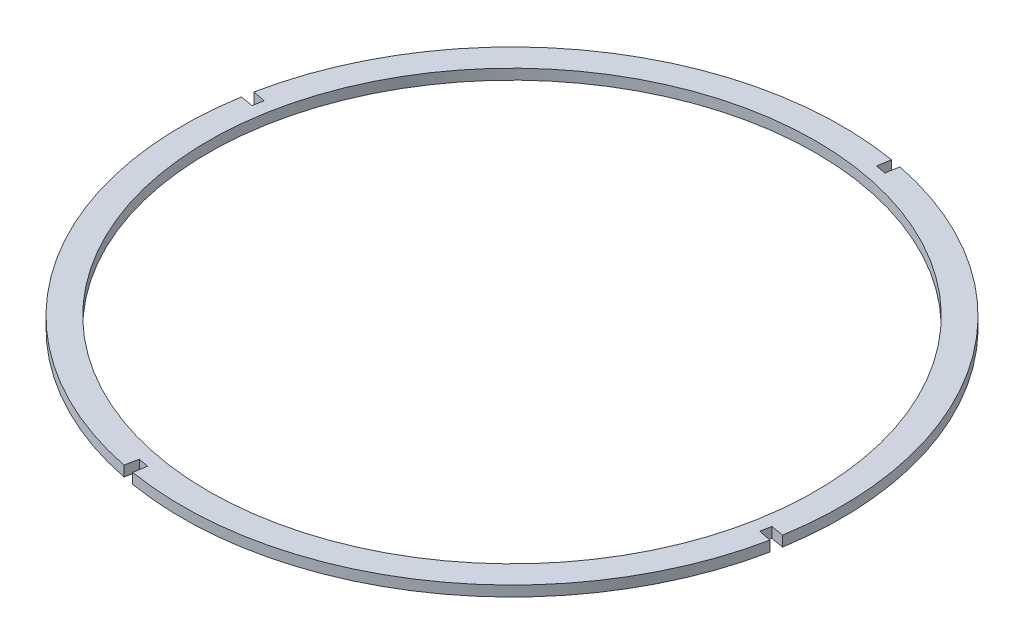
ISO-10303-21;
HEADER;
FILE_DESCRIPTION(('STEP AP214'),'2;1');
FILE_NAME('part.step','',(''),(''),'','','');
FILE_SCHEMA(('AUTOMOTIVE_DESIGN { 1 0 10303 214 1 1 1 1 }'));
ENDSEC;
DATA;
#1=APPLICATION_CONTEXT('core data for automotive mechanical design processes');
#2=APPLICATION_PROTOCOL_DEFINITION('international standard','automotive_design',2000,#1);
#3=PRODUCT_CONTEXT('',#1,'mechanical');
#4=PRODUCT('Part','Part','',(#3));
#5=PRODUCT_RELATED_PRODUCT_CATEGORY('part','',(#4));
#6=PRODUCT_DEFINITION_FORMATION('','',#4);
#7=PRODUCT_DEFINITION_CONTEXT('part definition',#1,'design');
#8=PRODUCT_DEFINITION('design','',#6,#7);
#9=PRODUCT_DEFINITION_SHAPE('','',#8);
#10=(LENGTH_UNIT() NAMED_UNIT(*) SI_UNIT(.MILLI.,.METRE.));
#11=(NAMED_UNIT(*) PLANE_ANGLE_UNIT() SI_UNIT($,.RADIAN.));
#12=(NAMED_UNIT(*) SI_UNIT($,.STERADIAN.) SOLID_ANGLE_UNIT());
#13=UNCERTAINTY_MEASURE_WITH_UNIT(LENGTH_MEASURE(1.E-05),#10,'distance_accuracy_value','');
#14=(GEOMETRIC_REPRESENTATION_CONTEXT(3) GLOBAL_UNCERTAINTY_ASSIGNED_CONTEXT((#13)) GLOBAL_UNIT_ASSIGNED_CONTEXT((#10,
#11,#12)) REPRESENTATION_CONTEXT('',''));
#15=CARTESIAN_POINT('',(0.,0.,0.));
#16=DIRECTION('',(0.,0.,1.));
#17=DIRECTION('',(1.,0.,0.));
#18=AXIS2_PLACEMENT_3D('',#15,#16,#17);
#19=CARTESIAN_POINT('',(-403.465651025362,16.,-173.034669454398));
#20=DIRECTION('',(0.,1.,0.));
#21=DIRECTION('',(0.,0.,1.));
#22=AXIS2_PLACEMENT_3D('',#19,#20,#21);
#23=PLANE('',#22);
#24=DIRECTION('',(0.165240023498245,0.,-0.986253382571791));
#25=VECTOR('',#24,1.);
#26=CARTESIAN_POINT('',(-322.977946121397,16.,-653.43445115636));
#27=LINE('',#26,#25);
#28=CARTESIAN_POINT('',(-322.977946121397,16.,-653.43445115636));
#29=VERTEX_POINT('',#28);
#30=CARTESIAN_POINT('',(-319.684001911055,16.,-673.094722019775));
#31=VERTEX_POINT('',#30);
#32=EDGE_CURVE('E242',#29,#31,#27,.T.);
#33=ORIENTED_EDGE('',*,*,#32,.T.);
#34=CARTESIAN_POINT('',(-403.465651025362,16.,-173.034669454398));
#35=DIRECTION('',(0.,1.,0.));
#36=DIRECTION('',(0.,0.,1.));
#37=AXIS2_PLACEMENT_3D('',#34,#35,#36);
#38=CIRCLE('',#37,507.03);
#39=CARTESIAN_POINT('',(-900.568839522135,16.,-272.873744401742));
#40=VERTEX_POINT('',#39);
#41=EDGE_CURVE('E130',#31,#40,#38,.T.);
#42=ORIENTED_EDGE('',*,*,#41,.T.);
#43=DIRECTION('',(0.983406473892087,0.,0.181415840287255));
#44=VECTOR('',#43,1.);
#45=CARTESIAN_POINT('',(-880.962779282727,16.,-269.256877940637));
#46=LINE('',#45,#44);
#47=CARTESIAN_POINT('',(-880.962779282727,16.,-269.256877940637));
#48=VERTEX_POINT('',#47);
#49=EDGE_CURVE('E295',#40,#48,#46,.T.);
#50=ORIENTED_EDGE('',*,*,#49,.T.);
#51=DIRECTION('',(-0.181415840287255,0.,0.983406473892088));
#52=VECTOR('',#51,1.);
#53=CARTESIAN_POINT('',(-880.962779282727,16.,-269.256877940637));
#54=LINE('',#53,#52);
#55=CARTESIAN_POINT('',(-883.865432727323,16.,-253.522374358363));
#56=VERTEX_POINT('',#55);
#57=EDGE_CURVE('E315',#48,#56,#54,.T.);
#58=ORIENTED_EDGE('',*,*,#57,.T.);
#59=DIRECTION('',(-0.986253382571794,0.,-0.165240023498229));
#60=VECTOR('',#59,1.);
#61=CARTESIAN_POINT('',(-883.865432727323,16.,-253.522374358363));
#62=LINE('',#61,#60);
#63=CARTESIAN_POINT('',(-903.525703590738,16.,-256.816318568705));
#64=VERTEX_POINT('',#63);
#65=EDGE_CURVE('E311',#56,#64,#62,.T.);
#66=ORIENTED_EDGE('',*,*,#65,.T.);
#67=CARTESIAN_POINT('',(-403.465651025362,16.,-173.034669454398));
#68=DIRECTION('',(0.,1.,0.));
#69=DIRECTION('',(0.,0.,1.));
#70=AXIS2_PLACEMENT_3D('',#67,#68,#69);
#71=CIRCLE('',#70,507.03);
#72=CARTESIAN_POINT('',(-503.338418417205,16.,324.061751004948));
#73=VERTEX_POINT('',#72);
#74=EDGE_CURVE('E314',#64,#73,#71,.T.);
#75=ORIENTED_EDGE('',*,*,#74,.T.);
#76=DIRECTION('',(0.196976051499661,0.,-0.98040830021762));
#77=VECTOR('',#76,1.);
#78=CARTESIAN_POINT('',(-499.411387281602,16.,304.515750913845));
#79=LINE('',#78,#77);
#80=CARTESIAN_POINT('',(-499.411387281602,16.,304.515750913845));
#81=VERTEX_POINT('',#80);
#82=EDGE_CURVE('E319',#73,#81,#79,.T.);
#83=ORIENTED_EDGE('',*,*,#82,.T.);
#84=DIRECTION('',(0.983458871104074,0.,0.181131578822411));
#85=VECTOR('',#84,1.);
#86=CARTESIAN_POINT('',(-499.411387281602,16.,304.515750913845));
#87=LINE('',#86,#85);
#88=CARTESIAN_POINT('',(-483.676045343937,16.,307.413856175003));
#89=VERTEX_POINT('',#88);
#90=EDGE_CURVE('E326',#81,#89,#87,.T.);
#91=ORIENTED_EDGE('',*,*,#90,.T.);
#92=DIRECTION('',(-0.164669920608711,0.,0.986348730037567));
#93=VECTOR('',#92,1.);
#94=CARTESIAN_POINT('',(-483.676045343937,16.,307.413856175003));
#95=LINE('',#94,#93);
#96=CARTESIAN_POINT('',(-486.958240871571,16.,327.073727136553));
#97=VERTEX_POINT('',#96);
#98=EDGE_CURVE('E329',#89,#97,#95,.T.);
#99=ORIENTED_EDGE('',*,*,#98,.T.);
#100=CARTESIAN_POINT('',(-403.465651025362,16.,-173.034669454398));
#101=DIRECTION('',(0.,1.,0.));
#102=DIRECTION('',(0.,0.,1.));
#103=AXIS2_PLACEMENT_3D('',#100,#101,#102);
#104=CIRCLE('',#103,507.03);
#105=CARTESIAN_POINT('',(93.5729575482181,16.,-72.8745851531181));
#106=VERTEX_POINT('',#105);
#107=EDGE_CURVE('E332',#97,#106,#104,.T.);
#108=ORIENTED_EDGE('',*,*,#107,.T.);
#109=DIRECTION('',(-0.980294279576317,0.,-0.197542717987653));
#110=VECTOR('',#109,1.);
#111=CARTESIAN_POINT('',(74.0314772320035,16.,-76.8124609681598));
#112=LINE('',#111,#110);
#113=CARTESIAN_POINT('',(74.0314772320035,16.,-76.8124609681598));
#114=VERTEX_POINT('',#113);
#115=EDGE_CURVE('E335',#106,#114,#112,.T.);
#116=ORIENTED_EDGE('',*,*,#115,.T.);
#117=DIRECTION('',(0.181415840287255,0.,-0.983406473892088));
#118=VECTOR('',#117,1.);
#119=CARTESIAN_POINT('',(76.9341306765996,16.,-92.5469645504332));
#120=LINE('',#119,#118);
#121=CARTESIAN_POINT('',(76.9341306765996,16.,-92.5469645504332));
#122=VERTEX_POINT('',#121);
#123=EDGE_CURVE('E338',#114,#122,#120,.T.);
#124=ORIENTED_EDGE('',*,*,#123,.T.);
#125=DIRECTION('',(0.986253382571794,0.,0.165240023498226));
#126=VECTOR('',#125,1.);
#127=CARTESIAN_POINT('',(76.9341306765996,16.,-92.5469645504332));
#128=LINE('',#127,#126);
#129=CARTESIAN_POINT('',(96.5944015400149,16.,-89.2530203400915));
#130=VERTEX_POINT('',#129);
#131=EDGE_CURVE('E173',#122,#130,#128,.T.);
#132=ORIENTED_EDGE('',*,*,#131,.T.);
#133=CARTESIAN_POINT('',(-403.465651025362,16.,-173.034669454398));
#134=DIRECTION('',(0.,1.,0.));
#135=DIRECTION('',(0.,0.,1.));
#136=AXIS2_PLACEMENT_3D('',#133,#134,#135);
#137=CIRCLE('',#136,507.03);
#138=CARTESIAN_POINT('',(-303.626576078017,16.,-670.137857951171));
#139=VERTEX_POINT('',#138);
#140=EDGE_CURVE('E167',#130,#139,#137,.T.);
#141=ORIENTED_EDGE('',*,*,#140,.T.);
#142=DIRECTION('',(-0.181415840287271,0.,0.983406473892085));
#143=VECTOR('',#142,1.);
#144=CARTESIAN_POINT('',(-307.243442539124,16.,-650.531797711764));
#145=LINE('',#144,#143);
#146=CARTESIAN_POINT('',(-307.243442539124,16.,-650.531797711764));
#147=VERTEX_POINT('',#146);
#148=EDGE_CURVE('E171',#139,#147,#145,.T.);
#149=ORIENTED_EDGE('',*,*,#148,.T.);
#150=DIRECTION('',(-0.983406473892088,0.,-0.181415840287254));
#151=VECTOR('',#150,1.);
#152=CARTESIAN_POINT('',(-322.977946121397,16.,-653.43445115636));
#153=LINE('',#152,#151);
#154=EDGE_CURVE('E63',#147,#29,#153,.T.);
#155=ORIENTED_EDGE('',*,*,#154,.T.);
#156=EDGE_LOOP('',(#33,#42,#50,#58,#66,#75,#83,#91,#99,#108,#116,#124,#132,#141,#149,#155));
#157=FACE_BOUND('',#156,.T.);
#158=CARTESIAN_POINT('',(-403.465651025362,16.,-173.034669454398));
#159=DIRECTION('',(0.,1.,0.));
#160=DIRECTION('',(0.,0.,1.));
#161=AXIS2_PLACEMENT_3D('',#158,#159,#160);
#162=CIRCLE('',#161,467.03);
#163=CARTESIAN_POINT('',(-403.465651025362,16.,293.995330545602));
#164=VERTEX_POINT('',#163);
#165=EDGE_CURVE('E200',#164,#164,#162,.T.);
#166=ORIENTED_EDGE('',*,*,#165,.F.);
#167=EDGE_LOOP('',(#166));
#168=FACE_BOUND('',#167,.T.);
#169=ADVANCED_FACE('F45',(#157,#168),#23,.T.);
#170=CARTESIAN_POINT('',(-403.465651025362,0.,-173.034669454398));
#171=DIRECTION('',(0.,1.,0.));
#172=DIRECTION('',(0.,0.,1.));
#173=AXIS2_PLACEMENT_3D('',#170,#171,#172);
#174=PLANE('',#173);
#175=DIRECTION('',(0.165240023498245,0.,-0.986253382571791));
#176=VECTOR('',#175,1.);
#177=CARTESIAN_POINT('',(-322.977946121397,0.,-653.43445115636));
#178=LINE('',#177,#176);
#179=CARTESIAN_POINT('',(-322.977946121397,0.,-653.43445115636));
#180=VERTEX_POINT('',#179);
#181=CARTESIAN_POINT('',(-319.684001911055,0.,-673.094722019775));
#182=VERTEX_POINT('',#181);
#183=EDGE_CURVE('E195',#180,#182,#178,.T.);
#184=ORIENTED_EDGE('',*,*,#183,.F.);
#185=DIRECTION('',(-0.983406473892088,0.,-0.181415840287254));
#186=VECTOR('',#185,1.);
#187=CARTESIAN_POINT('',(-322.977946121397,0.,-653.43445115636));
#188=LINE('',#187,#186);
#189=CARTESIAN_POINT('',(-307.243442539124,0.,-650.531797711764));
#190=VERTEX_POINT('',#189);
#191=EDGE_CURVE('E122',#190,#180,#188,.T.);
#192=ORIENTED_EDGE('',*,*,#191,.F.);
#193=DIRECTION('',(-0.181415840287271,0.,0.983406473892085));
#194=VECTOR('',#193,1.);
#195=CARTESIAN_POINT('',(-307.243442539124,0.,-650.531797711764));
#196=LINE('',#195,#194);
#197=CARTESIAN_POINT('',(-303.626576078017,0.,-670.137857951171));
#198=VERTEX_POINT('',#197);
#199=EDGE_CURVE('E116',#198,#190,#196,.T.);
#200=ORIENTED_EDGE('',*,*,#199,.F.);
#201=CARTESIAN_POINT('',(-403.465651025362,0.,-173.034669454398));
#202=DIRECTION('',(0.,1.,0.));
#203=DIRECTION('',(0.,0.,1.));
#204=AXIS2_PLACEMENT_3D('',#201,#202,#203);
#205=CIRCLE('',#204,507.03);
#206=CARTESIAN_POINT('',(96.5944015400149,0.,-89.2530203400915));
#207=VERTEX_POINT('',#206);
#208=EDGE_CURVE('E182',#207,#198,#205,.T.);
#209=ORIENTED_EDGE('',*,*,#208,.F.);
#210=DIRECTION('',(0.986253382571794,0.,0.165240023498226));
#211=VECTOR('',#210,1.);
#212=CARTESIAN_POINT('',(76.9341306765996,0.,-92.5469645504332));
#213=LINE('',#212,#211);
#214=CARTESIAN_POINT('',(76.9341306765996,0.,-92.5469645504332));
#215=VERTEX_POINT('',#214);
#216=EDGE_CURVE('E233',#215,#207,#213,.T.);
#217=ORIENTED_EDGE('',*,*,#216,.F.);
#218=DIRECTION('',(0.181415840287255,0.,-0.983406473892088));
#219=VECTOR('',#218,1.);
#220=CARTESIAN_POINT('',(76.9341306765996,0.,-92.5469645504332));
#221=LINE('',#220,#219);
#222=CARTESIAN_POINT('',(74.0314772320035,0.,-76.8124609681598));
#223=VERTEX_POINT('',#222);
#224=EDGE_CURVE('E230',#223,#215,#221,.T.);
#225=ORIENTED_EDGE('',*,*,#224,.F.);
#226=DIRECTION('',(-0.980294279576317,0.,-0.197542717987653));
#227=VECTOR('',#226,1.);
#228=CARTESIAN_POINT('',(74.0314772320035,0.,-76.8124609681598));
#229=LINE('',#228,#227);
#230=CARTESIAN_POINT('',(93.5729575482181,0.,-72.8745851531181));
#231=VERTEX_POINT('',#230);
#232=EDGE_CURVE('E227',#231,#223,#229,.T.);
#233=ORIENTED_EDGE('',*,*,#232,.F.);
#234=CARTESIAN_POINT('',(-403.465651025362,0.,-173.034669454398));
#235=DIRECTION('',(0.,1.,0.));
#236=DIRECTION('',(0.,0.,1.));
#237=AXIS2_PLACEMENT_3D('',#234,#235,#236);
#238=CIRCLE('',#237,507.03);
#239=CARTESIAN_POINT('',(-486.958240871571,0.,327.073727136553));
#240=VERTEX_POINT('',#239);
#241=EDGE_CURVE('E224',#240,#231,#238,.T.);
#242=ORIENTED_EDGE('',*,*,#241,.F.);
#243=DIRECTION('',(-0.164669920608711,0.,0.986348730037567));
#244=VECTOR('',#243,1.);
#245=CARTESIAN_POINT('',(-483.676045343937,0.,307.413856175003));
#246=LINE('',#245,#244);
#247=CARTESIAN_POINT('',(-483.676045343937,0.,307.413856175003));
#248=VERTEX_POINT('',#247);
#249=EDGE_CURVE('E221',#248,#240,#246,.T.);
#250=ORIENTED_EDGE('',*,*,#249,.F.);
#251=DIRECTION('',(0.983458871104074,0.,0.181131578822411));
#252=VECTOR('',#251,1.);
#253=CARTESIAN_POINT('',(-499.411387281602,0.,304.515750913845));
#254=LINE('',#253,#252);
#255=CARTESIAN_POINT('',(-499.411387281602,0.,304.515750913845));
#256=VERTEX_POINT('',#255);
#257=EDGE_CURVE('E218',#256,#248,#254,.T.);
#258=ORIENTED_EDGE('',*,*,#257,.F.);
#259=DIRECTION('',(0.196976051499661,0.,-0.98040830021762));
#260=VECTOR('',#259,1.);
#261=CARTESIAN_POINT('',(-499.411387281602,0.,304.515750913845));
#262=LINE('',#261,#260);
#263=CARTESIAN_POINT('',(-503.338418417205,0.,324.061751004948));
#264=VERTEX_POINT('',#263);
#265=EDGE_CURVE('E215',#264,#256,#262,.T.);
#266=ORIENTED_EDGE('',*,*,#265,.F.);
#267=CARTESIAN_POINT('',(-403.465651025362,0.,-173.034669454398));
#268=DIRECTION('',(0.,1.,0.));
#269=DIRECTION('',(0.,0.,1.));
#270=AXIS2_PLACEMENT_3D('',#267,#268,#269);
#271=CIRCLE('',#270,507.03);
#272=CARTESIAN_POINT('',(-903.525703590738,0.,-256.816318568705));
#273=VERTEX_POINT('',#272);
#274=EDGE_CURVE('E212',#273,#264,#271,.T.);
#275=ORIENTED_EDGE('',*,*,#274,.F.);
#276=DIRECTION('',(-0.986253382571794,0.,-0.165240023498229));
#277=VECTOR('',#276,1.);
#278=CARTESIAN_POINT('',(-883.865432727323,0.,-253.522374358363));
#279=LINE('',#278,#277);
#280=CARTESIAN_POINT('',(-883.865432727323,0.,-253.522374358363));
#281=VERTEX_POINT('',#280);
#282=EDGE_CURVE('E209',#281,#273,#279,.T.);
#283=ORIENTED_EDGE('',*,*,#282,.F.);
#284=DIRECTION('',(-0.181415840287255,0.,0.983406473892088));
#285=VECTOR('',#284,1.);
#286=CARTESIAN_POINT('',(-880.962779282727,0.,-269.256877940637));
#287=LINE('',#286,#285);
#288=CARTESIAN_POINT('',(-880.962779282727,0.,-269.256877940637));
#289=VERTEX_POINT('',#288);
#290=EDGE_CURVE('E206',#289,#281,#287,.T.);
#291=ORIENTED_EDGE('',*,*,#290,.F.);
#292=DIRECTION('',(0.983406473892087,0.,0.181415840287255));
#293=VECTOR('',#292,1.);
#294=CARTESIAN_POINT('',(-880.962779282727,0.,-269.256877940637));
#295=LINE('',#294,#293);
#296=CARTESIAN_POINT('',(-900.568839522135,0.,-272.873744401742));
#297=VERTEX_POINT('',#296);
#298=EDGE_CURVE('E203',#297,#289,#295,.T.);
#299=ORIENTED_EDGE('',*,*,#298,.F.);
#300=CARTESIAN_POINT('',(-403.465651025362,0.,-173.034669454398));
#301=DIRECTION('',(0.,1.,0.));
#302=DIRECTION('',(0.,0.,1.));
#303=AXIS2_PLACEMENT_3D('',#300,#301,#302);
#304=CIRCLE('',#303,507.03);
#305=EDGE_CURVE('E199',#182,#297,#304,.T.);
#306=ORIENTED_EDGE('',*,*,#305,.F.);
#307=EDGE_LOOP('',(#184,#192,#200,#209,#217,#225,#233,#242,#250,#258,#266,#275,#283,#291,#299,#306));
#308=FACE_BOUND('',#307,.T.);
#309=CARTESIAN_POINT('',(-403.465651025362,0.,-173.034669454398));
#310=DIRECTION('',(0.,1.,0.));
#311=DIRECTION('',(0.,0.,1.));
#312=AXIS2_PLACEMENT_3D('',#309,#310,#311);
#313=CIRCLE('',#312,467.03);
#314=CARTESIAN_POINT('',(-403.465651025362,0.,293.995330545602));
#315=VERTEX_POINT('',#314);
#316=EDGE_CURVE('E539',#315,#315,#313,.T.);
#317=ORIENTED_EDGE('',*,*,#316,.T.);
#318=EDGE_LOOP('',(#317));
#319=FACE_BOUND('',#318,.T.);
#320=ADVANCED_FACE('F299',(#308,#319),#174,.F.);
#321=CARTESIAN_POINT('',(-322.977946121397,16.,-653.43445115636));
#322=DIRECTION('',(-0.986253382571791,0.,-0.165240023498245));
#323=DIRECTION('',(-0.165240023498245,0.,0.986253382571791));
#324=AXIS2_PLACEMENT_3D('',#321,#322,#323);
#325=PLANE('',#324);
#326=ORIENTED_EDGE('',*,*,#183,.T.);
#327=DIRECTION('',(0.,-1.,0.));
#328=VECTOR('',#327,1.);
#329=CARTESIAN_POINT('',(-319.684001911055,16.,-673.094722019775));
#330=LINE('',#329,#328);
#331=EDGE_CURVE('E11',#31,#182,#330,.T.);
#332=ORIENTED_EDGE('',*,*,#331,.F.);
#333=ORIENTED_EDGE('',*,*,#32,.F.);
#334=DIRECTION('',(0.,-1.,0.));
#335=VECTOR('',#334,1.);
#336=CARTESIAN_POINT('',(-322.977946121397,16.,-653.43445115636));
#337=LINE('',#336,#335);
#338=EDGE_CURVE('E191',#29,#180,#337,.T.);
#339=ORIENTED_EDGE('',*,*,#338,.T.);
#340=EDGE_LOOP('',(#326,#332,#333,#339));
#341=FACE_BOUND('',#340,.T.);
#342=ADVANCED_FACE('F47',(#341),#325,.F.);
#343=CARTESIAN_POINT('',(-403.465651025362,16.,-173.034669454398));
#344=DIRECTION('',(0.,-1.,0.));
#345=DIRECTION('',(0.,0.,-1.));
#346=AXIS2_PLACEMENT_3D('',#343,#344,#345);
#347=CYLINDRICAL_SURFACE('',#346,507.03);
#348=ORIENTED_EDGE('',*,*,#305,.T.);
#349=DIRECTION('',(0.,-1.,0.));
#350=VECTOR('',#349,1.);
#351=CARTESIAN_POINT('',(-900.568839522135,16.,-272.873744401742));
#352=LINE('',#351,#350);
#353=EDGE_CURVE('E55',#40,#297,#352,.T.);
#354=ORIENTED_EDGE('',*,*,#353,.F.);
#355=ORIENTED_EDGE('',*,*,#41,.F.);
#356=ORIENTED_EDGE('',*,*,#331,.T.);
#357=EDGE_LOOP('',(#348,#354,#355,#356));
#358=FACE_BOUND('',#357,.T.);
#359=ADVANCED_FACE('F374',(#358),#347,.T.);
#360=CARTESIAN_POINT('',(-880.962779282727,16.,-269.256877940637));
#361=DIRECTION('',(0.181415840287255,0.,-0.983406473892087));
#362=DIRECTION('',(-0.983406473892088,0.,-0.181415840287255));
#363=AXIS2_PLACEMENT_3D('',#360,#361,#362);
#364=PLANE('',#363);
#365=ORIENTED_EDGE('',*,*,#298,.T.);
#366=DIRECTION('',(0.,-1.,0.));
#367=VECTOR('',#366,1.);
#368=CARTESIAN_POINT('',(-880.962779282727,16.,-269.256877940637));
#369=LINE('',#368,#367);
#370=EDGE_CURVE('E285',#48,#289,#369,.T.);
#371=ORIENTED_EDGE('',*,*,#370,.F.);
#372=ORIENTED_EDGE('',*,*,#49,.F.);
#373=ORIENTED_EDGE('',*,*,#353,.T.);
#374=EDGE_LOOP('',(#365,#371,#372,#373));
#375=FACE_BOUND('',#374,.T.);
#376=ADVANCED_FACE('F293',(#375),#364,.F.);
#377=CARTESIAN_POINT('',(-880.962779282727,16.,-269.256877940637));
#378=DIRECTION('',(0.983406473892088,0.,0.181415840287255));
#379=DIRECTION('',(0.181415840287255,0.,-0.983406473892088));
#380=AXIS2_PLACEMENT_3D('',#377,#378,#379);
#381=PLANE('',#380);
#382=ORIENTED_EDGE('',*,*,#290,.T.);
#383=DIRECTION('',(0.,-1.,0.));
#384=VECTOR('',#383,1.);
#385=CARTESIAN_POINT('',(-883.865432727323,16.,-253.522374358363));
#386=LINE('',#385,#384);
#387=EDGE_CURVE('E281',#56,#281,#386,.T.);
#388=ORIENTED_EDGE('',*,*,#387,.F.);
#389=ORIENTED_EDGE('',*,*,#57,.F.);
#390=ORIENTED_EDGE('',*,*,#370,.T.);
#391=EDGE_LOOP('',(#382,#388,#389,#390));
#392=FACE_BOUND('',#391,.T.);
#393=ADVANCED_FACE('F305',(#392),#381,.F.);
#394=CARTESIAN_POINT('',(-883.865432727323,16.,-253.522374358363));
#395=DIRECTION('',(-0.165240023498229,0.,0.986253382571794));
#396=DIRECTION('',(0.986253382571794,0.,0.165240023498229));
#397=AXIS2_PLACEMENT_3D('',#394,#395,#396);
#398=PLANE('',#397);
#399=ORIENTED_EDGE('',*,*,#282,.T.);
#400=DIRECTION('',(0.,-1.,0.));
#401=VECTOR('',#400,1.);
#402=CARTESIAN_POINT('',(-903.525703590738,16.,-256.816318568705));
#403=LINE('',#402,#401);
#404=EDGE_CURVE('E277',#64,#273,#403,.T.);
#405=ORIENTED_EDGE('',*,*,#404,.F.);
#406=ORIENTED_EDGE('',*,*,#65,.F.);
#407=ORIENTED_EDGE('',*,*,#387,.T.);
#408=EDGE_LOOP('',(#399,#405,#406,#407));
#409=FACE_BOUND('',#408,.T.);
#410=ADVANCED_FACE('F309',(#409),#398,.F.);
#411=CARTESIAN_POINT('',(-403.465651025362,16.,-173.034669454398));
#412=DIRECTION('',(0.,-1.,0.));
#413=DIRECTION('',(0.,0.,-1.));
#414=AXIS2_PLACEMENT_3D('',#411,#412,#413);
#415=CYLINDRICAL_SURFACE('',#414,507.03);
#416=ORIENTED_EDGE('',*,*,#274,.T.);
#417=DIRECTION('',(0.,-1.,0.));
#418=VECTOR('',#417,1.);
#419=CARTESIAN_POINT('',(-503.338418417205,16.,324.061751004948));
#420=LINE('',#419,#418);
#421=EDGE_CURVE('E273',#73,#264,#420,.T.);
#422=ORIENTED_EDGE('',*,*,#421,.F.);
#423=ORIENTED_EDGE('',*,*,#74,.F.);
#424=ORIENTED_EDGE('',*,*,#404,.T.);
#425=EDGE_LOOP('',(#416,#422,#423,#424));
#426=FACE_BOUND('',#425,.T.);
#427=ADVANCED_FACE('F387',(#426),#415,.T.);
#428=CARTESIAN_POINT('',(-499.411387281602,16.,304.515750913845));
#429=DIRECTION('',(-0.98040830021762,0.,-0.196976051499661));
#430=DIRECTION('',(-0.196976051499661,0.,0.98040830021762));
#431=AXIS2_PLACEMENT_3D('',#428,#429,#430);
#432=PLANE('',#431);
#433=ORIENTED_EDGE('',*,*,#265,.T.);
#434=DIRECTION('',(0.,-1.,0.));
#435=VECTOR('',#434,1.);
#436=CARTESIAN_POINT('',(-499.411387281602,16.,304.515750913845));
#437=LINE('',#436,#435);
#438=EDGE_CURVE('E269',#81,#256,#437,.T.);
#439=ORIENTED_EDGE('',*,*,#438,.F.);
#440=ORIENTED_EDGE('',*,*,#82,.F.);
#441=ORIENTED_EDGE('',*,*,#421,.T.);
#442=EDGE_LOOP('',(#433,#439,#440,#441));
#443=FACE_BOUND('',#442,.T.);
#444=ADVANCED_FACE('F390',(#443),#432,.F.);
#445=CARTESIAN_POINT('',(-499.411387281602,16.,304.515750913845));
#446=DIRECTION('',(0.181131578822411,0.,-0.983458871104074));
#447=DIRECTION('',(-0.983458871104074,0.,-0.181131578822411));
#448=AXIS2_PLACEMENT_3D('',#445,#446,#447);
#449=PLANE('',#448);
#450=ORIENTED_EDGE('',*,*,#257,.T.);
#451=DIRECTION('',(0.,-1.,0.));
#452=VECTOR('',#451,1.);
#453=CARTESIAN_POINT('',(-483.676045343937,16.,307.413856175003));
#454=LINE('',#453,#452);
#455=EDGE_CURVE('E265',#89,#248,#454,.T.);
#456=ORIENTED_EDGE('',*,*,#455,.F.);
#457=ORIENTED_EDGE('',*,*,#90,.F.);
#458=ORIENTED_EDGE('',*,*,#438,.T.);
#459=EDGE_LOOP('',(#450,#456,#457,#458));
#460=FACE_BOUND('',#459,.T.);
#461=ADVANCED_FACE('F394',(#460),#449,.F.);
#462=CARTESIAN_POINT('',(-483.676045343937,16.,307.413856175003));
#463=DIRECTION('',(0.986348730037567,0.,0.164669920608711));
#464=DIRECTION('',(0.164669920608711,0.,-0.986348730037567));
#465=AXIS2_PLACEMENT_3D('',#462,#463,#464);
#466=PLANE('',#465);
#467=ORIENTED_EDGE('',*,*,#249,.T.);
#468=DIRECTION('',(0.,-1.,0.));
#469=VECTOR('',#468,1.);
#470=CARTESIAN_POINT('',(-486.958240871571,16.,327.073727136553));
#471=LINE('',#470,#469);
#472=EDGE_CURVE('E261',#97,#240,#471,.T.);
#473=ORIENTED_EDGE('',*,*,#472,.F.);
#474=ORIENTED_EDGE('',*,*,#98,.F.);
#475=ORIENTED_EDGE('',*,*,#455,.T.);
#476=EDGE_LOOP('',(#467,#473,#474,#475));
#477=FACE_BOUND('',#476,.T.);
#478=ADVANCED_FACE('F398',(#477),#466,.F.);
#479=CARTESIAN_POINT('',(-403.465651025362,16.,-173.034669454398));
#480=DIRECTION('',(0.,-1.,0.));
#481=DIRECTION('',(0.,0.,-1.));
#482=AXIS2_PLACEMENT_3D('',#479,#480,#481);
#483=CYLINDRICAL_SURFACE('',#482,507.03);
#484=ORIENTED_EDGE('',*,*,#241,.T.);
#485=DIRECTION('',(0.,-1.,0.));
#486=VECTOR('',#485,1.);
#487=CARTESIAN_POINT('',(93.5729575482181,16.,-72.8745851531181));
#488=LINE('',#487,#486);
#489=EDGE_CURVE('E257',#106,#231,#488,.T.);
#490=ORIENTED_EDGE('',*,*,#489,.F.);
#491=ORIENTED_EDGE('',*,*,#107,.F.);
#492=ORIENTED_EDGE('',*,*,#472,.T.);
#493=EDGE_LOOP('',(#484,#490,#491,#492));
#494=FACE_BOUND('',#493,.T.);
#495=ADVANCED_FACE('F402',(#494),#483,.T.);
#496=CARTESIAN_POINT('',(74.0314772320035,16.,-76.8124609681598));
#497=DIRECTION('',(-0.197542717987653,0.,0.980294279576317));
#498=DIRECTION('',(0.980294279576317,0.,0.197542717987653));
#499=AXIS2_PLACEMENT_3D('',#496,#497,#498);
#500=PLANE('',#499);
#501=ORIENTED_EDGE('',*,*,#232,.T.);
#502=DIRECTION('',(0.,-1.,0.));
#503=VECTOR('',#502,1.);
#504=CARTESIAN_POINT('',(74.0314772320035,16.,-76.8124609681598));
#505=LINE('',#504,#503);
#506=EDGE_CURVE('E253',#114,#223,#505,.T.);
#507=ORIENTED_EDGE('',*,*,#506,.F.);
#508=ORIENTED_EDGE('',*,*,#115,.F.);
#509=ORIENTED_EDGE('',*,*,#489,.T.);
#510=EDGE_LOOP('',(#501,#507,#508,#509));
#511=FACE_BOUND('',#510,.T.);
#512=ADVANCED_FACE('F406',(#511),#500,.F.);
#513=CARTESIAN_POINT('',(76.9341306765996,16.,-92.5469645504332));
#514=DIRECTION('',(-0.983406473892088,0.,-0.181415840287255));
#515=DIRECTION('',(-0.181415840287255,0.,0.983406473892088));
#516=AXIS2_PLACEMENT_3D('',#513,#514,#515);
#517=PLANE('',#516);
#518=ORIENTED_EDGE('',*,*,#224,.T.);
#519=DIRECTION('',(0.,-1.,0.));
#520=VECTOR('',#519,1.);
#521=CARTESIAN_POINT('',(76.9341306765996,16.,-92.5469645504332));
#522=LINE('',#521,#520);
#523=EDGE_CURVE('E249',#122,#215,#522,.T.);
#524=ORIENTED_EDGE('',*,*,#523,.F.);
#525=ORIENTED_EDGE('',*,*,#123,.F.);
#526=ORIENTED_EDGE('',*,*,#506,.T.);
#527=EDGE_LOOP('',(#518,#524,#525,#526));
#528=FACE_BOUND('',#527,.T.);
#529=ADVANCED_FACE('F346',(#528),#517,.F.);
#530=CARTESIAN_POINT('',(76.9341306765996,16.,-92.5469645504332));
#531=DIRECTION('',(0.165240023498226,0.,-0.986253382571794));
#532=DIRECTION('',(-0.986253382571794,0.,-0.165240023498226));
#533=AXIS2_PLACEMENT_3D('',#530,#531,#532);
#534=PLANE('',#533);
#535=ORIENTED_EDGE('',*,*,#216,.T.);
#536=DIRECTION('',(0.,-1.,0.));
#537=VECTOR('',#536,1.);
#538=CARTESIAN_POINT('',(96.5944015400149,16.,-89.2530203400915));
#539=LINE('',#538,#537);
#540=EDGE_CURVE('E184',#130,#207,#539,.T.);
#541=ORIENTED_EDGE('',*,*,#540,.F.);
#542=ORIENTED_EDGE('',*,*,#131,.F.);
#543=ORIENTED_EDGE('',*,*,#523,.T.);
#544=EDGE_LOOP('',(#535,#541,#542,#543));
#545=FACE_BOUND('',#544,.T.);
#546=ADVANCED_FACE('F350',(#545),#534,.F.);
#547=CARTESIAN_POINT('',(-403.465651025362,16.,-173.034669454398));
#548=DIRECTION('',(0.,-1.,0.));
#549=DIRECTION('',(0.,0.,-1.));
#550=AXIS2_PLACEMENT_3D('',#547,#548,#549);
#551=CYLINDRICAL_SURFACE('',#550,507.03);
#552=ORIENTED_EDGE('',*,*,#208,.T.);
#553=DIRECTION('',(0.,-1.,0.));
#554=VECTOR('',#553,1.);
#555=CARTESIAN_POINT('',(-303.626576078017,16.,-670.137857951171));
#556=LINE('',#555,#554);
#557=EDGE_CURVE('E179',#139,#198,#556,.T.);
#558=ORIENTED_EDGE('',*,*,#557,.F.);
#559=ORIENTED_EDGE('',*,*,#140,.F.);
#560=ORIENTED_EDGE('',*,*,#540,.T.);
#561=EDGE_LOOP('',(#552,#558,#559,#560));
#562=FACE_BOUND('',#561,.T.);
#563=ADVANCED_FACE('F180',(#562),#551,.T.);
#564=CARTESIAN_POINT('',(-307.243442539124,16.,-650.531797711764));
#565=DIRECTION('',(0.983406473892085,0.,0.181415840287271));
#566=DIRECTION('',(0.181415840287271,0.,-0.983406473892085));
#567=AXIS2_PLACEMENT_3D('',#564,#565,#566);
#568=PLANE('',#567);
#569=ORIENTED_EDGE('',*,*,#199,.T.);
#570=DIRECTION('',(0.,-1.,0.));
#571=VECTOR('',#570,1.);
#572=CARTESIAN_POINT('',(-307.243442539124,16.,-650.531797711764));
#573=LINE('',#572,#571);
#574=EDGE_CURVE('E185',#147,#190,#573,.T.);
#575=ORIENTED_EDGE('',*,*,#574,.F.);
#576=ORIENTED_EDGE('',*,*,#148,.F.);
#577=ORIENTED_EDGE('',*,*,#557,.T.);
#578=EDGE_LOOP('',(#569,#575,#576,#577));
#579=FACE_BOUND('',#578,.T.);
#580=ADVANCED_FACE('F187',(#579),#568,.F.);
#581=CARTESIAN_POINT('',(-322.977946121397,16.,-653.43445115636));
#582=DIRECTION('',(-0.181415840287254,0.,0.983406473892088));
#583=DIRECTION('',(0.983406473892088,0.,0.181415840287254));
#584=AXIS2_PLACEMENT_3D('',#581,#582,#583);
#585=PLANE('',#584);
#586=ORIENTED_EDGE('',*,*,#191,.T.);
#587=ORIENTED_EDGE('',*,*,#338,.F.);
#588=ORIENTED_EDGE('',*,*,#154,.F.);
#589=ORIENTED_EDGE('',*,*,#574,.T.);
#590=EDGE_LOOP('',(#586,#587,#588,#589));
#591=FACE_BOUND('',#590,.T.);
#592=ADVANCED_FACE('F354',(#591),#585,.F.);
#593=CARTESIAN_POINT('',(-403.465651025362,16.,-173.034669454398));
#594=DIRECTION('',(0.,-1.,0.));
#595=DIRECTION('',(0.,0.,-1.));
#596=AXIS2_PLACEMENT_3D('',#593,#594,#595);
#597=CYLINDRICAL_SURFACE('',#596,467.03);
#598=ORIENTED_EDGE('',*,*,#165,.T.);
#599=EDGE_LOOP('',(#598));
#600=FACE_BOUND('',#599,.T.);
#601=ORIENTED_EDGE('',*,*,#316,.F.);
#602=EDGE_LOOP('',(#601));
#603=FACE_BOUND('',#602,.T.);
#604=ADVANCED_FACE('F356',(#600,#603),#597,.F.);
#605=CLOSED_SHELL('',(#169,#320,#342,#359,#376,#393,#410,#427,#444,#461,#478,#495,#512,#529,
#546,#563,#580,#592,#604));
#606=MANIFOLD_SOLID_BREP('B2',#605);
#607=ADVANCED_BREP_SHAPE_REPRESENTATION('',(#18,#606),#14);
#608=SHAPE_DEFINITION_REPRESENTATION(#9,#607);
ENDSEC;
END-ISO-10303-21;
